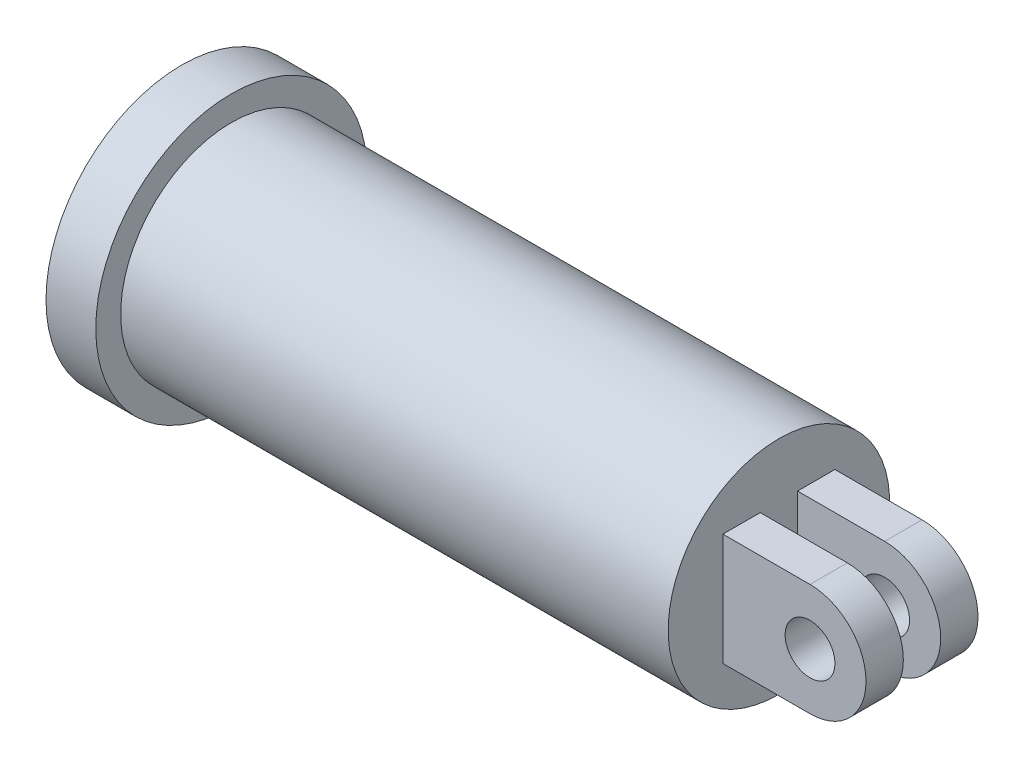
ISO-10303-21;
HEADER;
FILE_DESCRIPTION(('STEP AP214'),'2;1');
FILE_NAME('part.step','',(''),(''),'','','');
FILE_SCHEMA(('AUTOMOTIVE_DESIGN { 1 0 10303 214 1 1 1 1 }'));
ENDSEC;
DATA;
#1=APPLICATION_CONTEXT('core data for automotive mechanical design processes');
#2=APPLICATION_PROTOCOL_DEFINITION('international standard','automotive_design',2000,#1);
#3=PRODUCT_CONTEXT('',#1,'mechanical');
#4=PRODUCT('Part','Part','',(#3));
#5=PRODUCT_RELATED_PRODUCT_CATEGORY('part','',(#4));
#6=PRODUCT_DEFINITION_FORMATION('','',#4);
#7=PRODUCT_DEFINITION_CONTEXT('part definition',#1,'design');
#8=PRODUCT_DEFINITION('design','',#6,#7);
#9=PRODUCT_DEFINITION_SHAPE('','',#8);
#10=(LENGTH_UNIT() NAMED_UNIT(*) SI_UNIT(.MILLI.,.METRE.));
#11=(NAMED_UNIT(*) PLANE_ANGLE_UNIT() SI_UNIT($,.RADIAN.));
#12=(NAMED_UNIT(*) SI_UNIT($,.STERADIAN.) SOLID_ANGLE_UNIT());
#13=UNCERTAINTY_MEASURE_WITH_UNIT(LENGTH_MEASURE(1.E-05),#10,'distance_accuracy_value','');
#14=(GEOMETRIC_REPRESENTATION_CONTEXT(3) GLOBAL_UNCERTAINTY_ASSIGNED_CONTEXT((#13)) GLOBAL_UNIT_ASSIGNED_CONTEXT((#10,
#11,#12)) REPRESENTATION_CONTEXT('',''));
#15=CARTESIAN_POINT('',(0.,0.,0.));
#16=DIRECTION('',(0.,0.,1.));
#17=DIRECTION('',(1.,0.,0.));
#18=AXIS2_PLACEMENT_3D('',#15,#16,#17);
#19=CARTESIAN_POINT('',(120.,0.,0.));
#20=DIRECTION('',(-1.,0.,0.));
#21=DIRECTION('',(0.,-1.,0.));
#22=AXIS2_PLACEMENT_3D('',#19,#20,#21);
#23=PLANE('',#22);
#24=DIRECTION('',(0.,0.,-1.));
#25=VECTOR('',#24,1.);
#26=CARTESIAN_POINT('',(120.,-22.5,22.5));
#27=LINE('',#26,#25);
#28=CARTESIAN_POINT('',(120.,-22.5,22.5));
#29=VERTEX_POINT('',#28);
#30=CARTESIAN_POINT('',(120.,-22.5,7.5));
#31=VERTEX_POINT('',#30);
#32=EDGE_CURVE('E55',#29,#31,#27,.T.);
#33=ORIENTED_EDGE('',*,*,#32,.F.);
#34=DIRECTION('',(0.,-1.,0.));
#35=VECTOR('',#34,1.);
#36=CARTESIAN_POINT('',(120.,22.5,22.5));
#37=LINE('',#36,#35);
#38=CARTESIAN_POINT('',(120.,22.5,22.5));
#39=VERTEX_POINT('',#38);
#40=EDGE_CURVE('E132',#39,#29,#37,.T.);
#41=ORIENTED_EDGE('',*,*,#40,.F.);
#42=DIRECTION('',(0.,0.,-1.));
#43=VECTOR('',#42,1.);
#44=CARTESIAN_POINT('',(120.,22.5,22.5));
#45=LINE('',#44,#43);
#46=CARTESIAN_POINT('',(120.,22.5,7.5));
#47=VERTEX_POINT('',#46);
#48=EDGE_CURVE('E143',#39,#47,#45,.T.);
#49=ORIENTED_EDGE('',*,*,#48,.T.);
#50=DIRECTION('',(0.,-1.,0.));
#51=VECTOR('',#50,1.);
#52=CARTESIAN_POINT('',(120.,22.5,7.5));
#53=LINE('',#52,#51);
#54=EDGE_CURVE('E130',#47,#31,#53,.T.);
#55=ORIENTED_EDGE('',*,*,#54,.T.);
#56=EDGE_LOOP('',(#33,#41,#49,#55));
#57=FACE_BOUND('',#56,.T.);
#58=CARTESIAN_POINT('',(120.,0.,0.));
#59=DIRECTION('',(-1.,0.,0.));
#60=DIRECTION('',(0.,-1.,0.));
#61=AXIS2_PLACEMENT_3D('',#58,#59,#60);
#62=CIRCLE('',#61,44.5);
#63=CARTESIAN_POINT('',(120.,-44.4999999999999,0.));
#64=VERTEX_POINT('',#63);
#65=EDGE_CURVE('E11',#64,#64,#62,.T.);
#66=ORIENTED_EDGE('',*,*,#65,.F.);
#67=EDGE_LOOP('',(#66));
#68=FACE_BOUND('',#67,.T.);
#69=DIRECTION('',(0.,-1.,0.));
#70=VECTOR('',#69,1.);
#71=CARTESIAN_POINT('',(120.,22.5,-22.5));
#72=LINE('',#71,#70);
#73=CARTESIAN_POINT('',(120.,22.5,-22.5));
#74=VERTEX_POINT('',#73);
#75=CARTESIAN_POINT('',(120.,-22.5,-22.5));
#76=VERTEX_POINT('',#75);
#77=EDGE_CURVE('E99',#74,#76,#72,.T.);
#78=ORIENTED_EDGE('',*,*,#77,.T.);
#79=DIRECTION('',(0.,0.,1.));
#80=VECTOR('',#79,1.);
#81=CARTESIAN_POINT('',(120.,-22.5,-22.5));
#82=LINE('',#81,#80);
#83=CARTESIAN_POINT('',(120.,-22.5,-7.5));
#84=VERTEX_POINT('',#83);
#85=EDGE_CURVE('E246',#76,#84,#82,.T.);
#86=ORIENTED_EDGE('',*,*,#85,.T.);
#87=DIRECTION('',(0.,-1.,0.));
#88=VECTOR('',#87,1.);
#89=CARTESIAN_POINT('',(120.,22.5,-7.5));
#90=LINE('',#89,#88);
#91=CARTESIAN_POINT('',(120.,22.5,-7.5));
#92=VERTEX_POINT('',#91);
#93=EDGE_CURVE('E119',#92,#84,#90,.T.);
#94=ORIENTED_EDGE('',*,*,#93,.F.);
#95=DIRECTION('',(0.,0.,1.));
#96=VECTOR('',#95,1.);
#97=CARTESIAN_POINT('',(120.,22.5,-22.5));
#98=LINE('',#97,#96);
#99=EDGE_CURVE('E114',#74,#92,#98,.T.);
#100=ORIENTED_EDGE('',*,*,#99,.F.);
#101=EDGE_LOOP('',(#78,#86,#94,#100));
#102=FACE_BOUND('',#101,.T.);
#103=ADVANCED_FACE('F32',(#57,#68,#102),#23,.F.);
#104=CARTESIAN_POINT('',(-120.,54.5,0.));
#105=DIRECTION('',(1.,0.,0.));
#106=DIRECTION('',(0.,1.,0.));
#107=AXIS2_PLACEMENT_3D('',#104,#105,#106);
#108=PLANE('',#107);
#109=CARTESIAN_POINT('',(-120.,0.,0.));
#110=DIRECTION('',(-1.,0.,0.));
#111=DIRECTION('',(0.,-1.,0.));
#112=AXIS2_PLACEMENT_3D('',#109,#110,#111);
#113=CIRCLE('',#112,54.5);
#114=CARTESIAN_POINT('',(-120.,-54.5,0.));
#115=VERTEX_POINT('',#114);
#116=EDGE_CURVE('E159',#115,#115,#113,.T.);
#117=ORIENTED_EDGE('',*,*,#116,.T.);
#118=EDGE_LOOP('',(#117));
#119=FACE_BOUND('',#118,.T.);
#120=ADVANCED_FACE('F34',(#119),#108,.F.);
#121=CARTESIAN_POINT('',(-120.,0.,0.));
#122=DIRECTION('',(-1.,0.,0.));
#123=DIRECTION('',(0.,-1.,0.));
#124=AXIS2_PLACEMENT_3D('',#121,#122,#123);
#125=CYLINDRICAL_SURFACE('',#124,44.5);
#126=CARTESIAN_POINT('',(-100.,0.,0.));
#127=DIRECTION('',(-1.,0.,0.));
#128=DIRECTION('',(0.,-1.,0.));
#129=AXIS2_PLACEMENT_3D('',#126,#127,#128);
#130=CIRCLE('',#129,44.5);
#131=CARTESIAN_POINT('',(-100.,-44.5,0.));
#132=VERTEX_POINT('',#131);
#133=EDGE_CURVE('E40',#132,#132,#130,.T.);
#134=ORIENTED_EDGE('',*,*,#133,.F.);
#135=EDGE_LOOP('',(#134));
#136=FACE_BOUND('',#135,.T.);
#137=ORIENTED_EDGE('',*,*,#65,.T.);
#138=EDGE_LOOP('',(#137));
#139=FACE_BOUND('',#138,.T.);
#140=ADVANCED_FACE('F169',(#136,#139),#125,.T.);
#141=CARTESIAN_POINT('',(-100.,44.5,0.));
#142=DIRECTION('',(-1.,0.,0.));
#143=DIRECTION('',(0.,-1.,0.));
#144=AXIS2_PLACEMENT_3D('',#141,#142,#143);
#145=PLANE('',#144);
#146=CARTESIAN_POINT('',(-100.,0.,0.));
#147=DIRECTION('',(-1.,0.,0.));
#148=DIRECTION('',(0.,-1.,0.));
#149=AXIS2_PLACEMENT_3D('',#146,#147,#148);
#150=CIRCLE('',#149,54.5);
#151=CARTESIAN_POINT('',(-100.,-54.5,0.));
#152=VERTEX_POINT('',#151);
#153=EDGE_CURVE('E162',#152,#152,#150,.T.);
#154=ORIENTED_EDGE('',*,*,#153,.F.);
#155=EDGE_LOOP('',(#154));
#156=FACE_BOUND('',#155,.T.);
#157=ORIENTED_EDGE('',*,*,#133,.T.);
#158=EDGE_LOOP('',(#157));
#159=FACE_BOUND('',#158,.T.);
#160=ADVANCED_FACE('F167',(#156,#159),#145,.F.);
#161=CARTESIAN_POINT('',(-120.,0.,0.));
#162=DIRECTION('',(-1.,0.,0.));
#163=DIRECTION('',(0.,-1.,0.));
#164=AXIS2_PLACEMENT_3D('',#161,#162,#163);
#165=CYLINDRICAL_SURFACE('',#164,54.5);
#166=ORIENTED_EDGE('',*,*,#116,.F.);
#167=EDGE_LOOP('',(#166));
#168=FACE_BOUND('',#167,.T.);
#169=ORIENTED_EDGE('',*,*,#153,.T.);
#170=EDGE_LOOP('',(#169));
#171=FACE_BOUND('',#170,.T.);
#172=ADVANCED_FACE('F183',(#168,#171),#165,.T.);
#173=CARTESIAN_POINT('',(155.,0.,22.5));
#174=DIRECTION('',(0.,0.,-1.));
#175=DIRECTION('',(-1.,0.,0.));
#176=AXIS2_PLACEMENT_3D('',#173,#174,#175);
#177=PLANE('',#176);
#178=ORIENTED_EDGE('',*,*,#40,.T.);
#179=DIRECTION('',(1.,0.,0.));
#180=VECTOR('',#179,1.);
#181=CARTESIAN_POINT('',(120.,-22.5,22.5));
#182=LINE('',#181,#180);
#183=CARTESIAN_POINT('',(155.,-22.5,22.5));
#184=VERTEX_POINT('',#183);
#185=EDGE_CURVE('E135',#29,#184,#182,.T.);
#186=ORIENTED_EDGE('',*,*,#185,.T.);
#187=CARTESIAN_POINT('',(155.,0.,22.5));
#188=DIRECTION('',(0.,0.,1.));
#189=DIRECTION('',(-1.,0.,0.));
#190=AXIS2_PLACEMENT_3D('',#187,#188,#189);
#191=CIRCLE('',#190,22.5);
#192=CARTESIAN_POINT('',(155.,22.5,22.5));
#193=VERTEX_POINT('',#192);
#194=EDGE_CURVE('E138',#184,#193,#191,.T.);
#195=ORIENTED_EDGE('',*,*,#194,.T.);
#196=DIRECTION('',(-1.,0.,0.));
#197=VECTOR('',#196,1.);
#198=CARTESIAN_POINT('',(120.,22.5,22.5));
#199=LINE('',#198,#197);
#200=EDGE_CURVE('E140',#193,#39,#199,.T.);
#201=ORIENTED_EDGE('',*,*,#200,.T.);
#202=EDGE_LOOP('',(#178,#186,#195,#201));
#203=FACE_BOUND('',#202,.T.);
#204=CARTESIAN_POINT('',(155.,0.,22.5));
#205=DIRECTION('',(0.,0.,1.));
#206=DIRECTION('',(1.,0.,0.));
#207=AXIS2_PLACEMENT_3D('',#204,#205,#206);
#208=CIRCLE('',#207,10.);
#209=CARTESIAN_POINT('',(165.,0.,22.5));
#210=VERTEX_POINT('',#209);
#211=EDGE_CURVE('E123',#210,#210,#208,.T.);
#212=ORIENTED_EDGE('',*,*,#211,.F.);
#213=EDGE_LOOP('',(#212));
#214=FACE_BOUND('',#213,.T.);
#215=ADVANCED_FACE('F187',(#203,#214),#177,.F.);
#216=CARTESIAN_POINT('',(155.,0.,7.5));
#217=DIRECTION('',(0.,0.,-1.));
#218=DIRECTION('',(-1.,0.,0.));
#219=AXIS2_PLACEMENT_3D('',#216,#217,#218);
#220=PLANE('',#219);
#221=ORIENTED_EDGE('',*,*,#54,.F.);
#222=DIRECTION('',(-1.,0.,0.));
#223=VECTOR('',#222,1.);
#224=CARTESIAN_POINT('',(120.,22.5,7.5));
#225=LINE('',#224,#223);
#226=CARTESIAN_POINT('',(155.,22.5,7.5));
#227=VERTEX_POINT('',#226);
#228=EDGE_CURVE('E136',#227,#47,#225,.T.);
#229=ORIENTED_EDGE('',*,*,#228,.F.);
#230=CARTESIAN_POINT('',(155.,0.,7.5));
#231=DIRECTION('',(0.,0.,1.));
#232=DIRECTION('',(-1.,0.,0.));
#233=AXIS2_PLACEMENT_3D('',#230,#231,#232);
#234=CIRCLE('',#233,22.5);
#235=CARTESIAN_POINT('',(155.,-22.5,7.5));
#236=VERTEX_POINT('',#235);
#237=EDGE_CURVE('E147',#236,#227,#234,.T.);
#238=ORIENTED_EDGE('',*,*,#237,.F.);
#239=DIRECTION('',(1.,0.,0.));
#240=VECTOR('',#239,1.);
#241=CARTESIAN_POINT('',(120.,-22.5,7.5));
#242=LINE('',#241,#240);
#243=EDGE_CURVE('E145',#31,#236,#242,.T.);
#244=ORIENTED_EDGE('',*,*,#243,.F.);
#245=EDGE_LOOP('',(#221,#229,#238,#244));
#246=FACE_BOUND('',#245,.T.);
#247=CARTESIAN_POINT('',(155.,0.,7.5));
#248=DIRECTION('',(0.,0.,1.));
#249=DIRECTION('',(1.,0.,0.));
#250=AXIS2_PLACEMENT_3D('',#247,#248,#249);
#251=CIRCLE('',#250,10.);
#252=CARTESIAN_POINT('',(165.,0.,7.5));
#253=VERTEX_POINT('',#252);
#254=EDGE_CURVE('E120',#253,#253,#251,.T.);
#255=ORIENTED_EDGE('',*,*,#254,.T.);
#256=EDGE_LOOP('',(#255));
#257=FACE_BOUND('',#256,.T.);
#258=ADVANCED_FACE('F193',(#246,#257),#220,.T.);
#259=CARTESIAN_POINT('',(120.,-22.5,22.5));
#260=DIRECTION('',(0.,1.,0.));
#261=DIRECTION('',(0.,0.,1.));
#262=AXIS2_PLACEMENT_3D('',#259,#260,#261);
#263=PLANE('',#262);
#264=ORIENTED_EDGE('',*,*,#243,.T.);
#265=DIRECTION('',(0.,0.,-1.));
#266=VECTOR('',#265,1.);
#267=CARTESIAN_POINT('',(155.,-22.5,22.5));
#268=LINE('',#267,#266);
#269=EDGE_CURVE('E155',#184,#236,#268,.T.);
#270=ORIENTED_EDGE('',*,*,#269,.F.);
#271=ORIENTED_EDGE('',*,*,#185,.F.);
#272=ORIENTED_EDGE('',*,*,#32,.T.);
#273=EDGE_LOOP('',(#264,#270,#271,#272));
#274=FACE_BOUND('',#273,.T.);
#275=ADVANCED_FACE('F189',(#274),#263,.F.);
#276=CARTESIAN_POINT('',(155.,0.,22.5));
#277=DIRECTION('',(0.,0.,-1.));
#278=DIRECTION('',(-1.,0.,0.));
#279=AXIS2_PLACEMENT_3D('',#276,#277,#278);
#280=CYLINDRICAL_SURFACE('',#279,22.5);
#281=ORIENTED_EDGE('',*,*,#237,.T.);
#282=DIRECTION('',(0.,0.,-1.));
#283=VECTOR('',#282,1.);
#284=CARTESIAN_POINT('',(155.,22.5,22.5));
#285=LINE('',#284,#283);
#286=EDGE_CURVE('E152',#193,#227,#285,.T.);
#287=ORIENTED_EDGE('',*,*,#286,.F.);
#288=ORIENTED_EDGE('',*,*,#194,.F.);
#289=ORIENTED_EDGE('',*,*,#269,.T.);
#290=EDGE_LOOP('',(#281,#287,#288,#289));
#291=FACE_BOUND('',#290,.T.);
#292=ADVANCED_FACE('F192',(#291),#280,.T.);
#293=CARTESIAN_POINT('',(120.,22.5,22.5));
#294=DIRECTION('',(0.,-1.,0.));
#295=DIRECTION('',(0.,0.,-1.));
#296=AXIS2_PLACEMENT_3D('',#293,#294,#295);
#297=PLANE('',#296);
#298=ORIENTED_EDGE('',*,*,#228,.T.);
#299=ORIENTED_EDGE('',*,*,#48,.F.);
#300=ORIENTED_EDGE('',*,*,#200,.F.);
#301=ORIENTED_EDGE('',*,*,#286,.T.);
#302=EDGE_LOOP('',(#298,#299,#300,#301));
#303=FACE_BOUND('',#302,.T.);
#304=ADVANCED_FACE('F197',(#303),#297,.F.);
#305=CARTESIAN_POINT('',(155.,0.,22.5));
#306=DIRECTION('',(0.,0.,-1.));
#307=DIRECTION('',(-1.,0.,0.));
#308=AXIS2_PLACEMENT_3D('',#305,#306,#307);
#309=CYLINDRICAL_SURFACE('',#308,10.);
#310=ORIENTED_EDGE('',*,*,#211,.T.);
#311=EDGE_LOOP('',(#310));
#312=FACE_BOUND('',#311,.T.);
#313=ORIENTED_EDGE('',*,*,#254,.F.);
#314=EDGE_LOOP('',(#313));
#315=FACE_BOUND('',#314,.T.);
#316=ADVANCED_FACE('F201',(#312,#315),#309,.F.);
#317=CARTESIAN_POINT('',(120.,22.5,-22.5));
#318=DIRECTION('',(0.,1.,0.));
#319=DIRECTION('',(0.,0.,1.));
#320=AXIS2_PLACEMENT_3D('',#317,#318,#319);
#321=PLANE('',#320);
#322=DIRECTION('',(-1.,0.,0.));
#323=VECTOR('',#322,1.);
#324=CARTESIAN_POINT('',(120.,22.5,-7.5));
#325=LINE('',#324,#323);
#326=CARTESIAN_POINT('',(155.,22.5,-7.5));
#327=VERTEX_POINT('',#326);
#328=EDGE_CURVE('E47',#327,#92,#325,.T.);
#329=ORIENTED_EDGE('',*,*,#328,.F.);
#330=DIRECTION('',(0.,0.,1.));
#331=VECTOR('',#330,1.);
#332=CARTESIAN_POINT('',(155.,22.5,-22.5));
#333=LINE('',#332,#331);
#334=CARTESIAN_POINT('',(155.,22.5,-22.5));
#335=VERTEX_POINT('',#334);
#336=EDGE_CURVE('E116',#335,#327,#333,.T.);
#337=ORIENTED_EDGE('',*,*,#336,.F.);
#338=DIRECTION('',(-1.,0.,0.));
#339=VECTOR('',#338,1.);
#340=CARTESIAN_POINT('',(120.,22.5,-22.5));
#341=LINE('',#340,#339);
#342=EDGE_CURVE('E103',#335,#74,#341,.T.);
#343=ORIENTED_EDGE('',*,*,#342,.T.);
#344=ORIENTED_EDGE('',*,*,#99,.T.);
#345=EDGE_LOOP('',(#329,#337,#343,#344));
#346=FACE_BOUND('',#345,.T.);
#347=ADVANCED_FACE('F113',(#346),#321,.T.);
#348=CARTESIAN_POINT('',(155.,0.,-22.5));
#349=DIRECTION('',(0.,0.,1.));
#350=DIRECTION('',(1.,0.,0.));
#351=AXIS2_PLACEMENT_3D('',#348,#349,#350);
#352=CYLINDRICAL_SURFACE('',#351,22.5);
#353=CARTESIAN_POINT('',(155.,0.,-7.5));
#354=DIRECTION('',(0.,0.,1.));
#355=DIRECTION('',(-1.,0.,0.));
#356=AXIS2_PLACEMENT_3D('',#353,#354,#355);
#357=CIRCLE('',#356,22.5);
#358=CARTESIAN_POINT('',(155.,-22.5,-7.5));
#359=VERTEX_POINT('',#358);
#360=EDGE_CURVE('E249',#359,#327,#357,.T.);
#361=ORIENTED_EDGE('',*,*,#360,.F.);
#362=DIRECTION('',(0.,0.,1.));
#363=VECTOR('',#362,1.);
#364=CARTESIAN_POINT('',(155.,-22.5,-22.5));
#365=LINE('',#364,#363);
#366=CARTESIAN_POINT('',(155.,-22.5,-22.5));
#367=VERTEX_POINT('',#366);
#368=EDGE_CURVE('E125',#367,#359,#365,.T.);
#369=ORIENTED_EDGE('',*,*,#368,.F.);
#370=CARTESIAN_POINT('',(155.,0.,-22.5));
#371=DIRECTION('',(0.,0.,1.));
#372=DIRECTION('',(-1.,0.,0.));
#373=AXIS2_PLACEMENT_3D('',#370,#371,#372);
#374=CIRCLE('',#373,22.5);
#375=EDGE_CURVE('E117',#367,#335,#374,.T.);
#376=ORIENTED_EDGE('',*,*,#375,.T.);
#377=ORIENTED_EDGE('',*,*,#336,.T.);
#378=EDGE_LOOP('',(#361,#369,#376,#377));
#379=FACE_BOUND('',#378,.T.);
#380=ADVANCED_FACE('F214',(#379),#352,.T.);
#381=CARTESIAN_POINT('',(120.,-22.5,-22.5));
#382=DIRECTION('',(0.,-1.,0.));
#383=DIRECTION('',(0.,0.,-1.));
#384=AXIS2_PLACEMENT_3D('',#381,#382,#383);
#385=PLANE('',#384);
#386=DIRECTION('',(1.,0.,0.));
#387=VECTOR('',#386,1.);
#388=CARTESIAN_POINT('',(120.,-22.5,-7.5));
#389=LINE('',#388,#387);
#390=EDGE_CURVE('E110',#84,#359,#389,.T.);
#391=ORIENTED_EDGE('',*,*,#390,.F.);
#392=ORIENTED_EDGE('',*,*,#85,.F.);
#393=DIRECTION('',(1.,0.,0.));
#394=VECTOR('',#393,1.);
#395=CARTESIAN_POINT('',(120.,-22.5,-22.5));
#396=LINE('',#395,#394);
#397=EDGE_CURVE('E106',#76,#367,#396,.T.);
#398=ORIENTED_EDGE('',*,*,#397,.T.);
#399=ORIENTED_EDGE('',*,*,#368,.T.);
#400=EDGE_LOOP('',(#391,#392,#398,#399));
#401=FACE_BOUND('',#400,.T.);
#402=ADVANCED_FACE('F217',(#401),#385,.T.);
#403=CARTESIAN_POINT('',(155.,0.,-22.5));
#404=DIRECTION('',(0.,0.,1.));
#405=DIRECTION('',(-1.,0.,0.));
#406=AXIS2_PLACEMENT_3D('',#403,#404,#405);
#407=PLANE('',#406);
#408=CARTESIAN_POINT('',(155.,0.,-22.5));
#409=DIRECTION('',(0.,0.,1.));
#410=DIRECTION('',(1.,0.,0.));
#411=AXIS2_PLACEMENT_3D('',#408,#409,#410);
#412=CIRCLE('',#411,10.);
#413=CARTESIAN_POINT('',(165.,0.,-22.5));
#414=VERTEX_POINT('',#413);
#415=EDGE_CURVE('E237',#414,#414,#412,.T.);
#416=ORIENTED_EDGE('',*,*,#415,.T.);
#417=EDGE_LOOP('',(#416));
#418=FACE_BOUND('',#417,.T.);
#419=ORIENTED_EDGE('',*,*,#77,.F.);
#420=ORIENTED_EDGE('',*,*,#342,.F.);
#421=ORIENTED_EDGE('',*,*,#375,.F.);
#422=ORIENTED_EDGE('',*,*,#397,.F.);
#423=EDGE_LOOP('',(#419,#420,#421,#422));
#424=FACE_BOUND('',#423,.T.);
#425=ADVANCED_FACE('F101',(#418,#424),#407,.F.);
#426=CARTESIAN_POINT('',(155.,0.,-7.5));
#427=DIRECTION('',(0.,0.,1.));
#428=DIRECTION('',(-1.,0.,0.));
#429=AXIS2_PLACEMENT_3D('',#426,#427,#428);
#430=PLANE('',#429);
#431=CARTESIAN_POINT('',(155.,0.,-7.5));
#432=DIRECTION('',(0.,0.,1.));
#433=DIRECTION('',(1.,0.,0.));
#434=AXIS2_PLACEMENT_3D('',#431,#432,#433);
#435=CIRCLE('',#434,10.);
#436=CARTESIAN_POINT('',(165.,0.,-7.5));
#437=VERTEX_POINT('',#436);
#438=EDGE_CURVE('E240',#437,#437,#435,.T.);
#439=ORIENTED_EDGE('',*,*,#438,.F.);
#440=EDGE_LOOP('',(#439));
#441=FACE_BOUND('',#440,.T.);
#442=ORIENTED_EDGE('',*,*,#93,.T.);
#443=ORIENTED_EDGE('',*,*,#390,.T.);
#444=ORIENTED_EDGE('',*,*,#360,.T.);
#445=ORIENTED_EDGE('',*,*,#328,.T.);
#446=EDGE_LOOP('',(#442,#443,#444,#445));
#447=FACE_BOUND('',#446,.T.);
#448=ADVANCED_FACE('F222',(#441,#447),#430,.T.);
#449=CARTESIAN_POINT('',(155.,0.,-22.5));
#450=DIRECTION('',(0.,0.,1.));
#451=DIRECTION('',(1.,0.,0.));
#452=AXIS2_PLACEMENT_3D('',#449,#450,#451);
#453=CYLINDRICAL_SURFACE('',#452,10.);
#454=ORIENTED_EDGE('',*,*,#415,.F.);
#455=EDGE_LOOP('',(#454));
#456=FACE_BOUND('',#455,.T.);
#457=ORIENTED_EDGE('',*,*,#438,.T.);
#458=EDGE_LOOP('',(#457));
#459=FACE_BOUND('',#458,.T.);
#460=ADVANCED_FACE('F225',(#456,#459),#453,.F.);
#461=CLOSED_SHELL('',(#103,#120,#140,#160,#172,#215,#258,#275,#292,#304,#316,#347,#380,#402,
#425,#448,#460));
#462=MANIFOLD_SOLID_BREP('B2',#461);
#463=ADVANCED_BREP_SHAPE_REPRESENTATION('',(#18,#462),#14);
#464=SHAPE_DEFINITION_REPRESENTATION(#9,#463);
ENDSEC;
END-ISO-10303-21;
